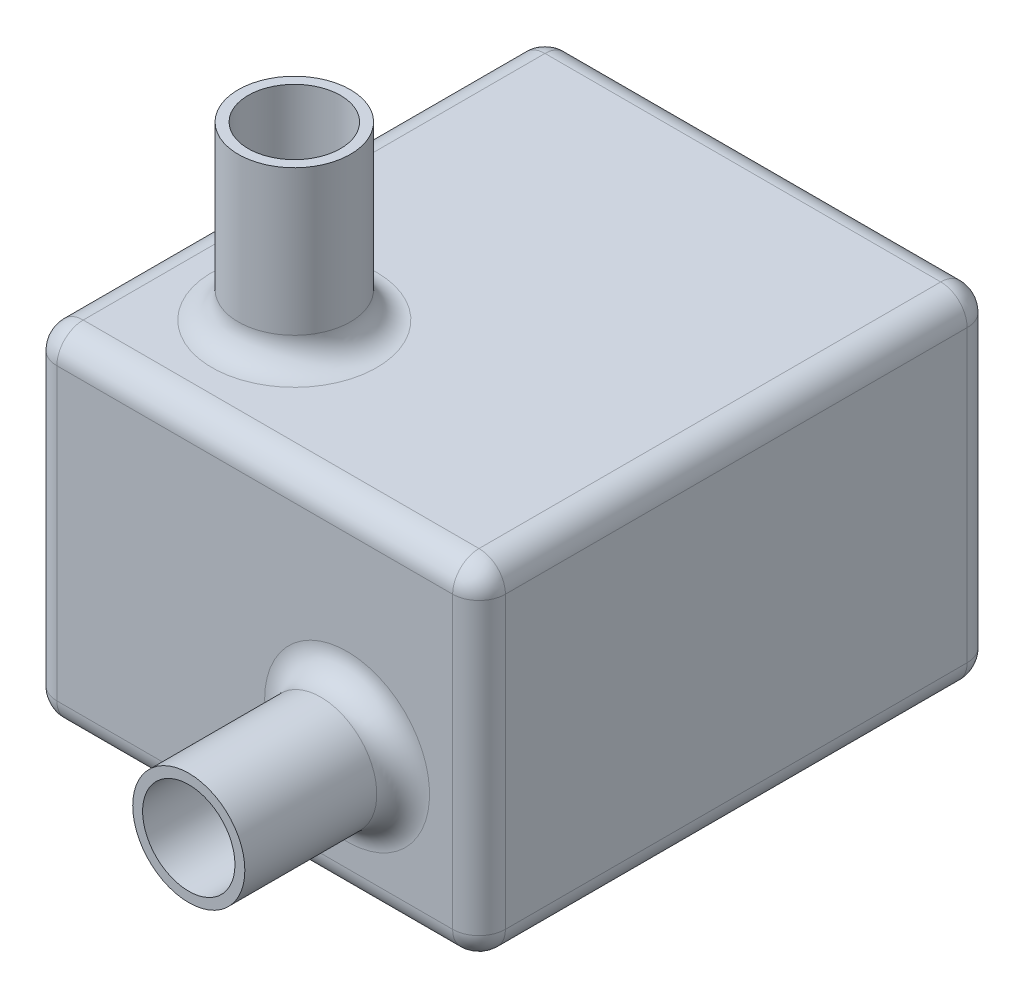
ISO-10303-21;
HEADER;
FILE_DESCRIPTION(('STEP AP214'),'2;1');
FILE_NAME('part.step','',(''),(''),'','','');
FILE_SCHEMA(('AUTOMOTIVE_DESIGN { 1 0 10303 214 1 1 1 1 }'));
ENDSEC;
DATA;
#1=APPLICATION_CONTEXT('core data for automotive mechanical design processes');
#2=APPLICATION_PROTOCOL_DEFINITION('international standard','automotive_design',2000,#1);
#3=PRODUCT_CONTEXT('',#1,'mechanical');
#4=PRODUCT('Part','Part','',(#3));
#5=PRODUCT_RELATED_PRODUCT_CATEGORY('part','',(#4));
#6=PRODUCT_DEFINITION_FORMATION('','',#4);
#7=PRODUCT_DEFINITION_CONTEXT('part definition',#1,'design');
#8=PRODUCT_DEFINITION('design','',#6,#7);
#9=PRODUCT_DEFINITION_SHAPE('','',#8);
#10=(LENGTH_UNIT() NAMED_UNIT(*) SI_UNIT(.MILLI.,.METRE.));
#11=(NAMED_UNIT(*) PLANE_ANGLE_UNIT() SI_UNIT($,.RADIAN.));
#12=(NAMED_UNIT(*) SI_UNIT($,.STERADIAN.) SOLID_ANGLE_UNIT());
#13=UNCERTAINTY_MEASURE_WITH_UNIT(LENGTH_MEASURE(1.E-05),#10,'distance_accuracy_value','');
#14=(GEOMETRIC_REPRESENTATION_CONTEXT(3) GLOBAL_UNCERTAINTY_ASSIGNED_CONTEXT((#13)) GLOBAL_UNIT_ASSIGNED_CONTEXT((#10,
#11,#12)) REPRESENTATION_CONTEXT('',''));
#15=CARTESIAN_POINT('',(0.,0.,0.));
#16=DIRECTION('',(0.,0.,1.));
#17=DIRECTION('',(1.,0.,0.));
#18=AXIS2_PLACEMENT_3D('',#15,#16,#17);
#19=CARTESIAN_POINT('',(17.,26.,19.5));
#20=DIRECTION('',(-1.,0.,0.));
#21=DIRECTION('',(0.,0.,1.));
#22=AXIS2_PLACEMENT_3D('',#19,#20,#21);
#23=PLANE('',#22);
#24=DIRECTION('',(0.,0.,-1.));
#25=VECTOR('',#24,1.);
#26=CARTESIAN_POINT('',(17.,2.,-19.5));
#27=LINE('',#26,#25);
#28=CARTESIAN_POINT('',(17.,2.,17.5));
#29=VERTEX_POINT('',#28);
#30=CARTESIAN_POINT('',(17.,2.,-17.5));
#31=VERTEX_POINT('',#30);
#32=EDGE_CURVE('E202',#29,#31,#27,.T.);
#33=ORIENTED_EDGE('',*,*,#32,.T.);
#34=DIRECTION('',(0.,-1.,0.));
#35=VECTOR('',#34,1.);
#36=CARTESIAN_POINT('',(17.,26.,-17.5));
#37=LINE('',#36,#35);
#38=CARTESIAN_POINT('',(17.,24.,-17.5));
#39=VERTEX_POINT('',#38);
#40=EDGE_CURVE('E205',#31,#39,#37,.F.);
#41=ORIENTED_EDGE('',*,*,#40,.T.);
#42=DIRECTION('',(0.,0.,-1.));
#43=VECTOR('',#42,1.);
#44=CARTESIAN_POINT('',(17.,24.,19.5));
#45=LINE('',#44,#43);
#46=CARTESIAN_POINT('',(17.,24.,17.5));
#47=VERTEX_POINT('',#46);
#48=EDGE_CURVE('E199',#39,#47,#45,.F.);
#49=ORIENTED_EDGE('',*,*,#48,.T.);
#50=DIRECTION('',(0.,-1.,0.));
#51=VECTOR('',#50,1.);
#52=CARTESIAN_POINT('',(17.,26.,17.5));
#53=LINE('',#52,#51);
#54=EDGE_CURVE('E196',#47,#29,#53,.T.);
#55=ORIENTED_EDGE('',*,*,#54,.T.);
#56=EDGE_LOOP('',(#33,#41,#49,#55));
#57=FACE_BOUND('',#56,.T.);
#58=ADVANCED_FACE('F47',(#57),#23,.F.);
#59=CARTESIAN_POINT('',(-17.,26.,-19.5));
#60=DIRECTION('',(0.,0.,1.));
#61=DIRECTION('',(1.,0.,0.));
#62=AXIS2_PLACEMENT_3D('',#59,#60,#61);
#63=PLANE('',#62);
#64=DIRECTION('',(0.,-1.,0.));
#65=VECTOR('',#64,1.);
#66=CARTESIAN_POINT('',(15.,26.,-19.5));
#67=LINE('',#66,#65);
#68=CARTESIAN_POINT('',(15.,24.,-19.5));
#69=VERTEX_POINT('',#68);
#70=CARTESIAN_POINT('',(15.,2.,-19.5));
#71=VERTEX_POINT('',#70);
#72=EDGE_CURVE('E177',#69,#71,#67,.T.);
#73=ORIENTED_EDGE('',*,*,#72,.T.);
#74=DIRECTION('',(-1.,0.,0.));
#75=VECTOR('',#74,1.);
#76=CARTESIAN_POINT('',(-17.,2.,-19.5));
#77=LINE('',#76,#75);
#78=CARTESIAN_POINT('',(-15.,2.,-19.5));
#79=VERTEX_POINT('',#78);
#80=EDGE_CURVE('E145',#71,#79,#77,.T.);
#81=ORIENTED_EDGE('',*,*,#80,.T.);
#82=DIRECTION('',(0.,-1.,0.));
#83=VECTOR('',#82,1.);
#84=CARTESIAN_POINT('',(-15.,26.,-19.5));
#85=LINE('',#84,#83);
#86=CARTESIAN_POINT('',(-15.,24.,-19.5));
#87=VERTEX_POINT('',#86);
#88=EDGE_CURVE('E165',#79,#87,#85,.F.);
#89=ORIENTED_EDGE('',*,*,#88,.T.);
#90=DIRECTION('',(-1.,0.,0.));
#91=VECTOR('',#90,1.);
#92=CARTESIAN_POINT('',(-17.,24.,-19.5));
#93=LINE('',#92,#91);
#94=EDGE_CURVE('E172',#87,#69,#93,.F.);
#95=ORIENTED_EDGE('',*,*,#94,.T.);
#96=EDGE_LOOP('',(#73,#81,#89,#95));
#97=FACE_BOUND('',#96,.T.);
#98=ADVANCED_FACE('F175',(#97),#63,.F.);
#99=CARTESIAN_POINT('',(-17.,26.,19.5));
#100=DIRECTION('',(1.,0.,0.));
#101=DIRECTION('',(0.,0.,-1.));
#102=AXIS2_PLACEMENT_3D('',#99,#100,#101);
#103=PLANE('',#102);
#104=DIRECTION('',(0.,0.,1.));
#105=VECTOR('',#104,1.);
#106=CARTESIAN_POINT('',(-17.,24.,19.5));
#107=LINE('',#106,#105);
#108=CARTESIAN_POINT('',(-17.,24.,17.5));
#109=VERTEX_POINT('',#108);
#110=CARTESIAN_POINT('',(-17.,24.,-17.5));
#111=VERTEX_POINT('',#110);
#112=EDGE_CURVE('E225',#109,#111,#107,.F.);
#113=ORIENTED_EDGE('',*,*,#112,.T.);
#114=DIRECTION('',(0.,-1.,0.));
#115=VECTOR('',#114,1.);
#116=CARTESIAN_POINT('',(-17.,26.,-17.5));
#117=LINE('',#116,#115);
#118=CARTESIAN_POINT('',(-17.,2.,-17.5));
#119=VERTEX_POINT('',#118);
#120=EDGE_CURVE('E231',#111,#119,#117,.T.);
#121=ORIENTED_EDGE('',*,*,#120,.T.);
#122=DIRECTION('',(0.,0.,1.));
#123=VECTOR('',#122,1.);
#124=CARTESIAN_POINT('',(-17.,2.,19.5));
#125=LINE('',#124,#123);
#126=CARTESIAN_POINT('',(-17.,2.,17.5));
#127=VERTEX_POINT('',#126);
#128=EDGE_CURVE('E228',#119,#127,#125,.T.);
#129=ORIENTED_EDGE('',*,*,#128,.T.);
#130=DIRECTION('',(0.,-1.,0.));
#131=VECTOR('',#130,1.);
#132=CARTESIAN_POINT('',(-17.,26.,17.5));
#133=LINE('',#132,#131);
#134=EDGE_CURVE('E222',#127,#109,#133,.F.);
#135=ORIENTED_EDGE('',*,*,#134,.T.);
#136=EDGE_LOOP('',(#113,#121,#129,#135));
#137=FACE_BOUND('',#136,.T.);
#138=ADVANCED_FACE('F352',(#137),#103,.F.);
#139=CARTESIAN_POINT('',(-17.,26.,19.5));
#140=DIRECTION('',(0.,0.,-1.));
#141=DIRECTION('',(-1.,0.,0.));
#142=AXIS2_PLACEMENT_3D('',#139,#140,#141);
#143=PLANE('',#142);
#144=CARTESIAN_POINT('',(7.,10.,19.5));
#145=DIRECTION('',(0.,0.,-1.));
#146=DIRECTION('',(-1.,0.,0.));
#147=AXIS2_PLACEMENT_3D('',#144,#145,#146);
#148=CIRCLE('',#147,6.25);
#149=CARTESIAN_POINT('',(0.750000000000004,10.,19.5));
#150=VERTEX_POINT('',#149);
#151=EDGE_CURVE('E327',#150,#150,#148,.T.);
#152=ORIENTED_EDGE('',*,*,#151,.T.);
#153=EDGE_LOOP('',(#152));
#154=FACE_BOUND('',#153,.T.);
#155=DIRECTION('',(1.,0.,0.));
#156=VECTOR('',#155,1.);
#157=CARTESIAN_POINT('',(-17.,24.,19.5));
#158=LINE('',#157,#156);
#159=CARTESIAN_POINT('',(15.,24.,19.5));
#160=VERTEX_POINT('',#159);
#161=CARTESIAN_POINT('',(-15.,24.,19.5));
#162=VERTEX_POINT('',#161);
#163=EDGE_CURVE('E235',#160,#162,#158,.F.);
#164=ORIENTED_EDGE('',*,*,#163,.T.);
#165=DIRECTION('',(0.,-1.,0.));
#166=VECTOR('',#165,1.);
#167=CARTESIAN_POINT('',(-15.,26.,19.5));
#168=LINE('',#167,#166);
#169=CARTESIAN_POINT('',(-15.,2.,19.5));
#170=VERTEX_POINT('',#169);
#171=EDGE_CURVE('E243',#162,#170,#168,.T.);
#172=ORIENTED_EDGE('',*,*,#171,.T.);
#173=DIRECTION('',(1.,0.,0.));
#174=VECTOR('',#173,1.);
#175=CARTESIAN_POINT('',(17.,2.,19.5));
#176=LINE('',#175,#174);
#177=CARTESIAN_POINT('',(15.,2.,19.5));
#178=VERTEX_POINT('',#177);
#179=EDGE_CURVE('E71',#170,#178,#176,.T.);
#180=ORIENTED_EDGE('',*,*,#179,.T.);
#181=DIRECTION('',(0.,-1.,0.));
#182=VECTOR('',#181,1.);
#183=CARTESIAN_POINT('',(15.,26.,19.5));
#184=LINE('',#183,#182);
#185=EDGE_CURVE('E238',#178,#160,#184,.F.);
#186=ORIENTED_EDGE('',*,*,#185,.T.);
#187=EDGE_LOOP('',(#164,#172,#180,#186));
#188=FACE_BOUND('',#187,.T.);
#189=ADVANCED_FACE('F435',(#154,#188),#143,.F.);
#190=CARTESIAN_POINT('',(0.,26.,0.));
#191=DIRECTION('',(0.,-1.,0.));
#192=DIRECTION('',(0.,0.,-1.));
#193=AXIS2_PLACEMENT_3D('',#190,#191,#192);
#194=PLANE('',#193);
#195=CARTESIAN_POINT('',(-7.,26.,9.49999999999999));
#196=DIRECTION('',(0.,-1.,0.));
#197=DIRECTION('',(0.,0.,-1.));
#198=AXIS2_PLACEMENT_3D('',#195,#196,#197);
#199=CIRCLE('',#198,6.25);
#200=CARTESIAN_POINT('',(-7.,26.,3.24999999999999));
#201=VERTEX_POINT('',#200);
#202=EDGE_CURVE('E11',#201,#201,#199,.T.);
#203=ORIENTED_EDGE('',*,*,#202,.T.);
#204=EDGE_LOOP('',(#203));
#205=FACE_BOUND('',#204,.T.);
#206=DIRECTION('',(0.,0.,-1.));
#207=VECTOR('',#206,1.);
#208=CARTESIAN_POINT('',(15.,26.,0.));
#209=LINE('',#208,#207);
#210=CARTESIAN_POINT('',(15.,26.,17.5));
#211=VERTEX_POINT('',#210);
#212=CARTESIAN_POINT('',(15.,26.,-17.5));
#213=VERTEX_POINT('',#212);
#214=EDGE_CURVE('E212',#211,#213,#209,.T.);
#215=ORIENTED_EDGE('',*,*,#214,.T.);
#216=DIRECTION('',(-1.,0.,0.));
#217=VECTOR('',#216,1.);
#218=CARTESIAN_POINT('',(0.,26.,-17.5));
#219=LINE('',#218,#217);
#220=CARTESIAN_POINT('',(-15.,26.,-17.5));
#221=VERTEX_POINT('',#220);
#222=EDGE_CURVE('E218',#213,#221,#219,.T.);
#223=ORIENTED_EDGE('',*,*,#222,.T.);
#224=DIRECTION('',(0.,0.,1.));
#225=VECTOR('',#224,1.);
#226=CARTESIAN_POINT('',(-15.,26.,0.));
#227=LINE('',#226,#225);
#228=CARTESIAN_POINT('',(-15.,26.,17.5));
#229=VERTEX_POINT('',#228);
#230=EDGE_CURVE('E215',#221,#229,#227,.T.);
#231=ORIENTED_EDGE('',*,*,#230,.T.);
#232=DIRECTION('',(1.,0.,0.));
#233=VECTOR('',#232,1.);
#234=CARTESIAN_POINT('',(0.,26.,17.5));
#235=LINE('',#234,#233);
#236=EDGE_CURVE('E209',#229,#211,#235,.T.);
#237=ORIENTED_EDGE('',*,*,#236,.T.);
#238=EDGE_LOOP('',(#215,#223,#231,#237));
#239=FACE_BOUND('',#238,.T.);
#240=ADVANCED_FACE('F448',(#205,#239),#194,.F.);
#241=CARTESIAN_POINT('',(0.,0.,0.));
#242=DIRECTION('',(0.,-1.,0.));
#243=DIRECTION('',(0.,0.,-1.));
#244=AXIS2_PLACEMENT_3D('',#241,#242,#243);
#245=PLANE('',#244);
#246=DIRECTION('',(0.,0.,1.));
#247=VECTOR('',#246,1.);
#248=CARTESIAN_POINT('',(-15.,0.,-19.5));
#249=LINE('',#248,#247);
#250=CARTESIAN_POINT('',(-15.,0.,17.5));
#251=VERTEX_POINT('',#250);
#252=CARTESIAN_POINT('',(-15.,0.,-17.5));
#253=VERTEX_POINT('',#252);
#254=EDGE_CURVE('E191',#251,#253,#249,.F.);
#255=ORIENTED_EDGE('',*,*,#254,.T.);
#256=DIRECTION('',(-1.,0.,0.));
#257=VECTOR('',#256,1.);
#258=CARTESIAN_POINT('',(17.,0.,-17.5));
#259=LINE('',#258,#257);
#260=CARTESIAN_POINT('',(15.,0.,-17.5));
#261=VERTEX_POINT('',#260);
#262=EDGE_CURVE('E147',#253,#261,#259,.F.);
#263=ORIENTED_EDGE('',*,*,#262,.T.);
#264=DIRECTION('',(0.,0.,-1.));
#265=VECTOR('',#264,1.);
#266=CARTESIAN_POINT('',(15.,0.,19.5));
#267=LINE('',#266,#265);
#268=CARTESIAN_POINT('',(15.,0.,17.5));
#269=VERTEX_POINT('',#268);
#270=EDGE_CURVE('E184',#261,#269,#267,.F.);
#271=ORIENTED_EDGE('',*,*,#270,.T.);
#272=DIRECTION('',(1.,0.,0.));
#273=VECTOR('',#272,1.);
#274=CARTESIAN_POINT('',(-17.,0.,17.5));
#275=LINE('',#274,#273);
#276=EDGE_CURVE('E180',#269,#251,#275,.F.);
#277=ORIENTED_EDGE('',*,*,#276,.T.);
#278=EDGE_LOOP('',(#255,#263,#271,#277));
#279=FACE_BOUND('',#278,.T.);
#280=ADVANCED_FACE('F469',(#279),#245,.T.);
#281=CARTESIAN_POINT('',(-7.,39.,9.49999999999999));
#282=DIRECTION('',(0.,-1.,0.));
#283=DIRECTION('',(0.,0.,-1.));
#284=AXIS2_PLACEMENT_3D('',#281,#282,#283);
#285=CYLINDRICAL_SURFACE('',#284,3.5);
#286=CARTESIAN_POINT('',(-7.,39.,9.49999999999999));
#287=DIRECTION('',(0.,1.,0.));
#288=DIRECTION('',(0.,0.,1.));
#289=AXIS2_PLACEMENT_3D('',#286,#287,#288);
#290=CIRCLE('',#289,3.5);
#291=CARTESIAN_POINT('',(-7.,39.,5.99999999999999));
#292=VERTEX_POINT('',#291);
#293=EDGE_CURVE('E519',#292,#292,#290,.T.);
#294=CARTESIAN_POINT('',(-7.,26.,9.49999999999999));
#295=DIRECTION('',(0.,1.,0.));
#296=DIRECTION('',(0.,0.,1.));
#297=AXIS2_PLACEMENT_3D('',#294,#295,#296);
#298=CIRCLE('',#297,3.5);
#299=CARTESIAN_POINT('',(-7.,26.,5.99999999999999));
#300=VERTEX_POINT('',#299);
#301=EDGE_CURVE('E514',#300,#300,#298,.T.);
#302=CARTESIAN_POINT('',(-7.,39.,5.99999999999999));
#303=CARTESIAN_POINT('',(-7.,38.8645833333333,5.99999999999999));
#304=CARTESIAN_POINT('',(-7.,38.7291666666667,5.99999999999999));
#305=CARTESIAN_POINT('',(-7.,38.4583333333333,5.99999999999999));
#306=CARTESIAN_POINT('',(-7.,38.3229166666667,5.99999999999999));
#307=CARTESIAN_POINT('',(-7.,38.0520833333333,5.99999999999999));
#308=CARTESIAN_POINT('',(-7.,37.9166666666667,5.99999999999999));
#309=CARTESIAN_POINT('',(-7.,37.6458333333333,5.99999999999999));
#310=CARTESIAN_POINT('',(-7.,37.5104166666667,5.99999999999999));
#311=CARTESIAN_POINT('',(-7.,37.2395833333333,5.99999999999999));
#312=CARTESIAN_POINT('',(-7.,37.1041666666667,5.99999999999999));
#313=CARTESIAN_POINT('',(-7.,36.8333333333333,5.99999999999999));
#314=CARTESIAN_POINT('',(-7.,36.6979166666667,5.99999999999999));
#315=CARTESIAN_POINT('',(-7.,36.4270833333333,5.99999999999999));
#316=CARTESIAN_POINT('',(-7.,36.2916666666667,5.99999999999999));
#317=CARTESIAN_POINT('',(-7.,36.0208333333333,5.99999999999999));
#318=CARTESIAN_POINT('',(-7.,35.8854166666667,5.99999999999999));
#319=CARTESIAN_POINT('',(-7.,35.6145833333333,5.99999999999999));
#320=CARTESIAN_POINT('',(-7.,35.4791666666667,5.99999999999999));
#321=CARTESIAN_POINT('',(-7.,35.2083333333333,5.99999999999999));
#322=CARTESIAN_POINT('',(-7.,35.0729166666667,5.99999999999999));
#323=CARTESIAN_POINT('',(-7.,34.8020833333333,5.99999999999999));
#324=CARTESIAN_POINT('',(-7.,34.6666666666667,5.99999999999999));
#325=CARTESIAN_POINT('',(-7.,34.3958333333333,5.99999999999999));
#326=CARTESIAN_POINT('',(-7.,34.2604166666667,5.99999999999999));
#327=CARTESIAN_POINT('',(-7.,33.9895833333333,5.99999999999999));
#328=CARTESIAN_POINT('',(-7.,33.8541666666667,5.99999999999999));
#329=CARTESIAN_POINT('',(-7.,33.5833333333333,5.99999999999999));
#330=CARTESIAN_POINT('',(-7.,33.4479166666667,5.99999999999999));
#331=CARTESIAN_POINT('',(-7.,33.1770833333333,5.99999999999999));
#332=CARTESIAN_POINT('',(-7.,33.0416666666667,5.99999999999999));
#333=CARTESIAN_POINT('',(-7.,32.7708333333333,5.99999999999999));
#334=CARTESIAN_POINT('',(-7.,32.6354166666667,5.99999999999999));
#335=CARTESIAN_POINT('',(-7.,32.3645833333333,5.99999999999999));
#336=CARTESIAN_POINT('',(-7.,32.2291666666667,5.99999999999999));
#337=CARTESIAN_POINT('',(-7.,31.9583333333333,5.99999999999999));
#338=CARTESIAN_POINT('',(-7.,31.8229166666667,5.99999999999999));
#339=CARTESIAN_POINT('',(-7.,31.5520833333333,5.99999999999999));
#340=CARTESIAN_POINT('',(-7.,31.4166666666667,5.99999999999999));
#341=CARTESIAN_POINT('',(-7.,31.1458333333333,5.99999999999999));
#342=CARTESIAN_POINT('',(-7.,31.0104166666667,5.99999999999999));
#343=CARTESIAN_POINT('',(-7.,30.7395833333333,5.99999999999999));
#344=CARTESIAN_POINT('',(-7.,30.6041666666667,5.99999999999999));
#345=CARTESIAN_POINT('',(-7.,30.3333333333333,5.99999999999999));
#346=CARTESIAN_POINT('',(-7.,30.1979166666667,5.99999999999999));
#347=CARTESIAN_POINT('',(-7.,29.9270833333333,5.99999999999999));
#348=CARTESIAN_POINT('',(-7.,29.7916666666667,5.99999999999999));
#349=CARTESIAN_POINT('',(-7.,29.5208333333333,5.99999999999999));
#350=CARTESIAN_POINT('',(-7.,29.3854166666667,5.99999999999999));
#351=CARTESIAN_POINT('',(-7.,29.1145833333333,5.99999999999999));
#352=CARTESIAN_POINT('',(-7.,28.9791666666667,5.99999999999999));
#353=CARTESIAN_POINT('',(-7.,28.7083333333333,5.99999999999999));
#354=CARTESIAN_POINT('',(-7.,28.5729166666667,5.99999999999999));
#355=CARTESIAN_POINT('',(-7.,28.3020833333333,5.99999999999999));
#356=CARTESIAN_POINT('',(-7.,28.1666666666667,5.99999999999999));
#357=CARTESIAN_POINT('',(-7.,27.8958333333333,5.99999999999999));
#358=CARTESIAN_POINT('',(-7.,27.7604166666667,5.99999999999999));
#359=CARTESIAN_POINT('',(-7.,27.4895833333333,5.99999999999999));
#360=CARTESIAN_POINT('',(-7.,27.3541666666667,5.99999999999999));
#361=CARTESIAN_POINT('',(-7.,27.0833333333333,5.99999999999999));
#362=CARTESIAN_POINT('',(-7.,26.9479166666667,5.99999999999999));
#363=CARTESIAN_POINT('',(-7.,26.6770833333333,5.99999999999999));
#364=CARTESIAN_POINT('',(-7.,26.5416666666667,5.99999999999999));
#365=CARTESIAN_POINT('',(-7.,26.2708333333333,5.99999999999999));
#366=CARTESIAN_POINT('',(-7.,26.1354166666667,5.99999999999999));
#367=CARTESIAN_POINT('',(-7.,26.,5.99999999999999));
#368=B_SPLINE_CURVE_WITH_KNOTS('',3,(#302,#303,#304,#305,#306,#307,#308,#309,#310,#311,#312,
#313,#314,#315,#316,#317,#318,#319,#320,#321,#322,#323,#324,#325,#326,#327,#328,#329,#330,#331,
#332,#333,#334,#335,#336,#337,#338,#339,#340,#341,#342,#343,#344,#345,#346,#347,#348,#349,#350,
#351,#352,#353,#354,#355,#356,#357,#358,#359,#360,#361,#362,#363,#364,#365,#366,#367),
.UNSPECIFIED.,.F.,.F.,(4,2,2,2,2,2,2,2,2,2,2,2,2,2,2,2,2,2,2,2,2,2,2,2,2,2,2,2,2,2,2,2,4),(0.,
0.406250000000004,0.812500000000001,1.21875,1.625,2.03125000000001,2.4375,2.84375000000001,3.25,
3.65625000000001,4.0625,4.46875,4.875,5.28125,5.68750000000001,6.09375,6.50000000000001,6.90625,
7.31250000000001,7.71875,8.125,8.53125,8.9375,9.34375000000001,9.75,10.15625,10.5625,10.96875,
11.375,11.78125,12.1875,12.59375,13.),.UNSPECIFIED.);
#369=EDGE_CURVE('BSEAM479',#292,#300,#368,.T.);
#370=ORIENTED_EDGE('',*,*,#293,.T.);
#371=ORIENTED_EDGE('',*,*,#301,.F.);
#372=ORIENTED_EDGE('',*,*,#369,.T.);
#373=ORIENTED_EDGE('',*,*,#369,.F.);
#374=EDGE_LOOP('',(#370,#372,#371,#373));
#375=FACE_BOUND('',#374,.T.);
#376=ADVANCED_FACE('F479',(#375),#285,.F.);
#377=CARTESIAN_POINT('',(-7.,39.,9.49999999999999));
#378=DIRECTION('',(0.,-1.,0.));
#379=DIRECTION('',(0.,0.,-1.));
#380=AXIS2_PLACEMENT_3D('',#377,#378,#379);
#381=CYLINDRICAL_SURFACE('',#380,4.25);
#382=CARTESIAN_POINT('',(-7.,28.,9.49999999999999));
#383=DIRECTION('',(0.,-1.,0.));
#384=DIRECTION('',(0.,0.,-1.));
#385=AXIS2_PLACEMENT_3D('',#382,#383,#384);
#386=CIRCLE('',#385,4.25);
#387=CARTESIAN_POINT('',(-7.,28.,5.24999999999999));
#388=VERTEX_POINT('',#387);
#389=EDGE_CURVE('E56',#388,#388,#386,.F.);
#390=CARTESIAN_POINT('',(-7.,39.,9.49999999999999));
#391=DIRECTION('',(0.,1.,0.));
#392=DIRECTION('',(0.,0.,1.));
#393=AXIS2_PLACEMENT_3D('',#390,#391,#392);
#394=CIRCLE('',#393,4.25);
#395=CARTESIAN_POINT('',(-7.,39.,5.24999999999999));
#396=VERTEX_POINT('',#395);
#397=EDGE_CURVE('E173',#396,#396,#394,.T.);
#398=CARTESIAN_POINT('',(-7.,28.,5.24999999999999));
#399=CARTESIAN_POINT('',(-7.,28.1145833333333,5.24999999999999));
#400=CARTESIAN_POINT('',(-7.,28.2291666666667,5.24999999999999));
#401=CARTESIAN_POINT('',(-7.,28.4583333333333,5.24999999999999));
#402=CARTESIAN_POINT('',(-7.,28.5729166666667,5.24999999999999));
#403=CARTESIAN_POINT('',(-7.,28.8020833333333,5.24999999999999));
#404=CARTESIAN_POINT('',(-7.,28.9166666666667,5.24999999999999));
#405=CARTESIAN_POINT('',(-7.,29.1458333333333,5.24999999999999));
#406=CARTESIAN_POINT('',(-7.,29.2604166666667,5.24999999999999));
#407=CARTESIAN_POINT('',(-7.,29.4895833333333,5.24999999999999));
#408=CARTESIAN_POINT('',(-7.,29.6041666666667,5.24999999999999));
#409=CARTESIAN_POINT('',(-7.,29.8333333333333,5.24999999999999));
#410=CARTESIAN_POINT('',(-7.,29.9479166666667,5.24999999999999));
#411=CARTESIAN_POINT('',(-7.,30.1770833333333,5.24999999999999));
#412=CARTESIAN_POINT('',(-7.,30.2916666666667,5.24999999999999));
#413=CARTESIAN_POINT('',(-7.,30.5208333333333,5.24999999999999));
#414=CARTESIAN_POINT('',(-7.,30.6354166666667,5.24999999999999));
#415=CARTESIAN_POINT('',(-7.,30.8645833333333,5.24999999999999));
#416=CARTESIAN_POINT('',(-7.,30.9791666666667,5.24999999999999));
#417=CARTESIAN_POINT('',(-7.,31.2083333333333,5.24999999999999));
#418=CARTESIAN_POINT('',(-7.,31.3229166666667,5.24999999999999));
#419=CARTESIAN_POINT('',(-7.,31.5520833333333,5.24999999999999));
#420=CARTESIAN_POINT('',(-7.,31.6666666666667,5.24999999999999));
#421=CARTESIAN_POINT('',(-7.,31.8958333333333,5.24999999999999));
#422=CARTESIAN_POINT('',(-7.,32.0104166666667,5.24999999999999));
#423=CARTESIAN_POINT('',(-7.,32.2395833333333,5.24999999999999));
#424=CARTESIAN_POINT('',(-7.,32.3541666666667,5.24999999999999));
#425=CARTESIAN_POINT('',(-7.,32.5833333333333,5.24999999999999));
#426=CARTESIAN_POINT('',(-7.,32.6979166666667,5.24999999999999));
#427=CARTESIAN_POINT('',(-7.,32.9270833333333,5.24999999999999));
#428=CARTESIAN_POINT('',(-7.,33.0416666666667,5.24999999999999));
#429=CARTESIAN_POINT('',(-7.,33.2708333333333,5.24999999999999));
#430=CARTESIAN_POINT('',(-7.,33.3854166666667,5.24999999999999));
#431=CARTESIAN_POINT('',(-7.,33.6145833333333,5.24999999999999));
#432=CARTESIAN_POINT('',(-7.,33.7291666666667,5.24999999999999));
#433=CARTESIAN_POINT('',(-7.,33.9583333333333,5.24999999999999));
#434=CARTESIAN_POINT('',(-7.,34.0729166666667,5.24999999999999));
#435=CARTESIAN_POINT('',(-7.,34.3020833333333,5.24999999999999));
#436=CARTESIAN_POINT('',(-7.,34.4166666666667,5.24999999999999));
#437=CARTESIAN_POINT('',(-7.,34.6458333333333,5.24999999999999));
#438=CARTESIAN_POINT('',(-7.,34.7604166666667,5.24999999999999));
#439=CARTESIAN_POINT('',(-7.,34.9895833333333,5.24999999999999));
#440=CARTESIAN_POINT('',(-7.,35.1041666666667,5.24999999999999));
#441=CARTESIAN_POINT('',(-7.,35.3333333333333,5.24999999999999));
#442=CARTESIAN_POINT('',(-7.,35.4479166666667,5.24999999999999));
#443=CARTESIAN_POINT('',(-7.,35.6770833333333,5.24999999999999));
#444=CARTESIAN_POINT('',(-7.,35.7916666666667,5.24999999999999));
#445=CARTESIAN_POINT('',(-7.,36.0208333333333,5.24999999999999));
#446=CARTESIAN_POINT('',(-7.,36.1354166666667,5.24999999999999));
#447=CARTESIAN_POINT('',(-7.,36.3645833333333,5.24999999999999));
#448=CARTESIAN_POINT('',(-7.,36.4791666666667,5.24999999999999));
#449=CARTESIAN_POINT('',(-7.,36.7083333333333,5.24999999999999));
#450=CARTESIAN_POINT('',(-7.,36.8229166666667,5.24999999999999));
#451=CARTESIAN_POINT('',(-7.,37.0520833333333,5.24999999999999));
#452=CARTESIAN_POINT('',(-7.,37.1666666666667,5.24999999999999));
#453=CARTESIAN_POINT('',(-7.,37.3958333333333,5.24999999999999));
#454=CARTESIAN_POINT('',(-7.,37.5104166666667,5.24999999999999));
#455=CARTESIAN_POINT('',(-7.,37.7395833333333,5.24999999999999));
#456=CARTESIAN_POINT('',(-7.,37.8541666666667,5.24999999999999));
#457=CARTESIAN_POINT('',(-7.,38.0833333333333,5.24999999999999));
#458=CARTESIAN_POINT('',(-7.,38.1979166666667,5.24999999999999));
#459=CARTESIAN_POINT('',(-7.,38.4270833333333,5.24999999999999));
#460=CARTESIAN_POINT('',(-7.,38.5416666666667,5.24999999999999));
#461=CARTESIAN_POINT('',(-7.,38.7708333333333,5.24999999999999));
#462=CARTESIAN_POINT('',(-7.,38.8854166666667,5.24999999999999));
#463=CARTESIAN_POINT('',(-7.,39.,5.24999999999999));
#464=B_SPLINE_CURVE_WITH_KNOTS('',3,(#398,#399,#400,#401,#402,#403,#404,#405,#406,#407,#408,
#409,#410,#411,#412,#413,#414,#415,#416,#417,#418,#419,#420,#421,#422,#423,#424,#425,#426,#427,
#428,#429,#430,#431,#432,#433,#434,#435,#436,#437,#438,#439,#440,#441,#442,#443,#444,#445,#446,
#447,#448,#449,#450,#451,#452,#453,#454,#455,#456,#457,#458,#459,#460,#461,#462,#463),
.UNSPECIFIED.,.F.,.F.,(4,2,2,2,2,2,2,2,2,2,2,2,2,2,2,2,2,2,2,2,2,2,2,2,2,2,2,2,2,2,2,2,4),(0.,
0.343750000000004,0.687500000000001,1.03125,1.375,1.71875,2.0625,2.40625,2.75,3.09375,3.4375,
3.78125,4.125,4.46875,4.8125,5.15625,5.5,5.84375,6.1875,6.53125,6.875,7.21875,7.5625,7.90625,
8.25,8.59375,8.9375,9.28125,9.625,9.96875,10.3125,10.65625,11.),.UNSPECIFIED.);
#465=EDGE_CURVE('BSEAM334',#388,#396,#464,.T.);
#466=ORIENTED_EDGE('',*,*,#389,.T.);
#467=ORIENTED_EDGE('',*,*,#397,.F.);
#468=ORIENTED_EDGE('',*,*,#465,.T.);
#469=ORIENTED_EDGE('',*,*,#465,.F.);
#470=EDGE_LOOP('',(#466,#468,#467,#469));
#471=FACE_BOUND('',#470,.T.);
#472=ADVANCED_FACE('F334',(#471),#381,.T.);
#473=CARTESIAN_POINT('',(0.,39.,0.));
#474=DIRECTION('',(0.,1.,0.));
#475=DIRECTION('',(0.,0.,1.));
#476=AXIS2_PLACEMENT_3D('',#473,#474,#475);
#477=PLANE('',#476);
#478=ORIENTED_EDGE('',*,*,#293,.F.);
#479=EDGE_LOOP('',(#478));
#480=FACE_BOUND('',#479,.T.);
#481=ORIENTED_EDGE('',*,*,#397,.T.);
#482=EDGE_LOOP('',(#481));
#483=FACE_BOUND('',#482,.T.);
#484=ADVANCED_FACE('F489',(#480,#483),#477,.T.);
#485=ORIENTED_EDGE('',*,*,#301,.T.);
#486=EDGE_LOOP('',(#485));
#487=FACE_BOUND('',#486,.T.);
#488=ADVANCED_FACE('F483',(#487),#194,.F.);
#489=CARTESIAN_POINT('',(7.,10.,31.5));
#490=DIRECTION('',(0.,0.,-1.));
#491=DIRECTION('',(-1.,0.,0.));
#492=AXIS2_PLACEMENT_3D('',#489,#490,#491);
#493=CYLINDRICAL_SURFACE('',#492,3.5);
#494=CARTESIAN_POINT('',(7.,10.,31.5));
#495=DIRECTION('',(0.,0.,1.));
#496=DIRECTION('',(1.,0.,0.));
#497=AXIS2_PLACEMENT_3D('',#494,#495,#496);
#498=CIRCLE('',#497,3.5);
#499=CARTESIAN_POINT('',(10.5,10.,31.5));
#500=VERTEX_POINT('',#499);
#501=EDGE_CURVE('E508',#500,#500,#498,.T.);
#502=ORIENTED_EDGE('',*,*,#501,.T.);
#503=EDGE_LOOP('',(#502));
#504=FACE_BOUND('',#503,.T.);
#505=CARTESIAN_POINT('',(7.,10.,19.5));
#506=DIRECTION('',(0.,0.,1.));
#507=DIRECTION('',(1.,0.,0.));
#508=AXIS2_PLACEMENT_3D('',#505,#506,#507);
#509=CIRCLE('',#508,3.5);
#510=CARTESIAN_POINT('',(10.5,10.,19.5));
#511=VERTEX_POINT('',#510);
#512=EDGE_CURVE('E323',#511,#511,#509,.T.);
#513=ORIENTED_EDGE('',*,*,#512,.F.);
#514=EDGE_LOOP('',(#513));
#515=FACE_BOUND('',#514,.T.);
#516=ADVANCED_FACE('F493',(#504,#515),#493,.F.);
#517=CARTESIAN_POINT('',(7.,10.,31.5));
#518=DIRECTION('',(0.,0.,-1.));
#519=DIRECTION('',(-1.,0.,0.));
#520=AXIS2_PLACEMENT_3D('',#517,#518,#519);
#521=CYLINDRICAL_SURFACE('',#520,4.25);
#522=CARTESIAN_POINT('',(7.,10.,21.5));
#523=DIRECTION('',(0.,0.,-1.));
#524=DIRECTION('',(-1.,0.,0.));
#525=AXIS2_PLACEMENT_3D('',#522,#523,#524);
#526=CIRCLE('',#525,4.25);
#527=CARTESIAN_POINT('',(2.75,10.,21.5));
#528=VERTEX_POINT('',#527);
#529=EDGE_CURVE('E245',#528,#528,#526,.F.);
#530=ORIENTED_EDGE('',*,*,#529,.T.);
#531=EDGE_LOOP('',(#530));
#532=FACE_BOUND('',#531,.T.);
#533=CARTESIAN_POINT('',(7.,10.,31.5));
#534=DIRECTION('',(0.,0.,1.));
#535=DIRECTION('',(1.,0.,0.));
#536=AXIS2_PLACEMENT_3D('',#533,#534,#535);
#537=CIRCLE('',#536,4.25);
#538=CARTESIAN_POINT('',(11.25,10.,31.5));
#539=VERTEX_POINT('',#538);
#540=EDGE_CURVE('E511',#539,#539,#537,.T.);
#541=ORIENTED_EDGE('',*,*,#540,.F.);
#542=EDGE_LOOP('',(#541));
#543=FACE_BOUND('',#542,.T.);
#544=ADVANCED_FACE('F496',(#532,#543),#521,.T.);
#545=CARTESIAN_POINT('',(0.,0.,31.5));
#546=DIRECTION('',(0.,0.,1.));
#547=DIRECTION('',(1.,0.,0.));
#548=AXIS2_PLACEMENT_3D('',#545,#546,#547);
#549=PLANE('',#548);
#550=ORIENTED_EDGE('',*,*,#501,.F.);
#551=EDGE_LOOP('',(#550));
#552=FACE_BOUND('',#551,.T.);
#553=ORIENTED_EDGE('',*,*,#540,.T.);
#554=EDGE_LOOP('',(#553));
#555=FACE_BOUND('',#554,.T.);
#556=ADVANCED_FACE('F432',(#552,#555),#549,.T.);
#557=ORIENTED_EDGE('',*,*,#512,.T.);
#558=EDGE_LOOP('',(#557));
#559=FACE_BOUND('',#558,.T.);
#560=ADVANCED_FACE('F427',(#559),#143,.F.);
#561=CARTESIAN_POINT('',(0.,24.,17.5));
#562=DIRECTION('',(1.,0.,0.));
#563=DIRECTION('',(0.,0.,-1.));
#564=AXIS2_PLACEMENT_3D('',#561,#562,#563);
#565=CYLINDRICAL_SURFACE('',#564,2.);
#566=CARTESIAN_POINT('',(15.,24.,17.5));
#567=DIRECTION('',(1.,0.,0.));
#568=DIRECTION('',(0.,0.,-1.));
#569=AXIS2_PLACEMENT_3D('',#566,#567,#568);
#570=CIRCLE('',#569,2.);
#571=EDGE_CURVE('E319',#211,#160,#570,.T.);
#572=ORIENTED_EDGE('',*,*,#571,.F.);
#573=ORIENTED_EDGE('',*,*,#236,.F.);
#574=CARTESIAN_POINT('',(-15.,24.,17.5));
#575=DIRECTION('',(-1.,0.,0.));
#576=DIRECTION('',(0.,0.,1.));
#577=AXIS2_PLACEMENT_3D('',#574,#575,#576);
#578=CIRCLE('',#577,2.);
#579=EDGE_CURVE('E315',#162,#229,#578,.T.);
#580=ORIENTED_EDGE('',*,*,#579,.F.);
#581=ORIENTED_EDGE('',*,*,#163,.F.);
#582=EDGE_LOOP('',(#572,#573,#580,#581));
#583=FACE_BOUND('',#582,.T.);
#584=ADVANCED_FACE('F424',(#583),#565,.T.);
#585=CARTESIAN_POINT('',(15.,24.,17.5));
#586=DIRECTION('',(0.,0.,1.));
#587=DIRECTION('',(1.,0.,0.));
#588=AXIS2_PLACEMENT_3D('',#585,#586,#587);
#589=SPHERICAL_SURFACE('',#588,2.);
#590=CARTESIAN_POINT('',(15.,24.,17.5));
#591=DIRECTION('',(0.,0.,1.));
#592=DIRECTION('',(1.,0.,0.));
#593=AXIS2_PLACEMENT_3D('',#590,#591,#592);
#594=CIRCLE('',#593,2.);
#595=EDGE_CURVE('E307',#211,#47,#594,.F.);
#596=ORIENTED_EDGE('',*,*,#595,.F.);
#597=ORIENTED_EDGE('',*,*,#571,.T.);
#598=CARTESIAN_POINT('',(15.,24.,17.5));
#599=DIRECTION('',(0.,1.,0.));
#600=DIRECTION('',(0.,0.,1.));
#601=AXIS2_PLACEMENT_3D('',#598,#599,#600);
#602=CIRCLE('',#601,2.);
#603=EDGE_CURVE('E311',#47,#160,#602,.F.);
#604=ORIENTED_EDGE('',*,*,#603,.F.);
#605=EDGE_LOOP('',(#596,#597,#604));
#606=FACE_BOUND('',#605,.T.);
#607=ADVANCED_FACE('F420',(#606),#589,.T.);
#608=CARTESIAN_POINT('',(-15.,24.,17.5));
#609=DIRECTION('',(0.,1.,0.));
#610=DIRECTION('',(0.,0.,1.));
#611=AXIS2_PLACEMENT_3D('',#608,#609,#610);
#612=SPHERICAL_SURFACE('',#611,2.);
#613=CARTESIAN_POINT('',(-15.,24.,17.5));
#614=DIRECTION('',(0.,1.,0.));
#615=DIRECTION('',(0.,0.,1.));
#616=AXIS2_PLACEMENT_3D('',#613,#614,#615);
#617=CIRCLE('',#616,2.);
#618=EDGE_CURVE('E299',#162,#109,#617,.F.);
#619=ORIENTED_EDGE('',*,*,#618,.F.);
#620=ORIENTED_EDGE('',*,*,#579,.T.);
#621=CARTESIAN_POINT('',(-15.,24.,17.5));
#622=DIRECTION('',(0.,0.,1.));
#623=DIRECTION('',(1.,0.,0.));
#624=AXIS2_PLACEMENT_3D('',#621,#622,#623);
#625=CIRCLE('',#624,2.);
#626=EDGE_CURVE('E303',#109,#229,#625,.F.);
#627=ORIENTED_EDGE('',*,*,#626,.F.);
#628=EDGE_LOOP('',(#619,#620,#627));
#629=FACE_BOUND('',#628,.T.);
#630=ADVANCED_FACE('F416',(#629),#612,.T.);
#631=CARTESIAN_POINT('',(15.,26.,17.5));
#632=DIRECTION('',(0.,-1.,0.));
#633=DIRECTION('',(0.,0.,-1.));
#634=AXIS2_PLACEMENT_3D('',#631,#632,#633);
#635=CYLINDRICAL_SURFACE('',#634,2.);
#636=ORIENTED_EDGE('',*,*,#603,.T.);
#637=ORIENTED_EDGE('',*,*,#185,.F.);
#638=CARTESIAN_POINT('',(15.,2.,17.5));
#639=DIRECTION('',(0.,-1.,0.));
#640=DIRECTION('',(0.,0.,-1.));
#641=AXIS2_PLACEMENT_3D('',#638,#639,#640);
#642=CIRCLE('',#641,2.);
#643=EDGE_CURVE('E291',#29,#178,#642,.T.);
#644=ORIENTED_EDGE('',*,*,#643,.F.);
#645=ORIENTED_EDGE('',*,*,#54,.F.);
#646=EDGE_LOOP('',(#636,#637,#644,#645));
#647=FACE_BOUND('',#646,.T.);
#648=ADVANCED_FACE('F412',(#647),#635,.T.);
#649=CARTESIAN_POINT('',(15.,24.,0.));
#650=DIRECTION('',(0.,0.,-1.));
#651=DIRECTION('',(-1.,0.,0.));
#652=AXIS2_PLACEMENT_3D('',#649,#650,#651);
#653=CYLINDRICAL_SURFACE('',#652,2.);
#654=ORIENTED_EDGE('',*,*,#595,.T.);
#655=ORIENTED_EDGE('',*,*,#48,.F.);
#656=CARTESIAN_POINT('',(15.,24.,-17.5));
#657=DIRECTION('',(0.,0.,-1.));
#658=DIRECTION('',(-1.,0.,0.));
#659=AXIS2_PLACEMENT_3D('',#656,#657,#658);
#660=CIRCLE('',#659,2.);
#661=EDGE_CURVE('E287',#213,#39,#660,.T.);
#662=ORIENTED_EDGE('',*,*,#661,.F.);
#663=ORIENTED_EDGE('',*,*,#214,.F.);
#664=EDGE_LOOP('',(#654,#655,#662,#663));
#665=FACE_BOUND('',#664,.T.);
#666=ADVANCED_FACE('F408',(#665),#653,.T.);
#667=CARTESIAN_POINT('',(0.,24.,-17.5));
#668=DIRECTION('',(-1.,0.,0.));
#669=DIRECTION('',(0.,0.,1.));
#670=AXIS2_PLACEMENT_3D('',#667,#668,#669);
#671=CYLINDRICAL_SURFACE('',#670,2.);
#672=CARTESIAN_POINT('',(-15.,24.,-17.5));
#673=DIRECTION('',(-1.,0.,0.));
#674=DIRECTION('',(0.,0.,1.));
#675=AXIS2_PLACEMENT_3D('',#672,#673,#674);
#676=CIRCLE('',#675,2.);
#677=EDGE_CURVE('E279',#221,#87,#676,.T.);
#678=ORIENTED_EDGE('',*,*,#677,.F.);
#679=ORIENTED_EDGE('',*,*,#222,.F.);
#680=CARTESIAN_POINT('',(15.,24.,-17.5));
#681=DIRECTION('',(1.,0.,0.));
#682=DIRECTION('',(0.,1.,0.));
#683=AXIS2_PLACEMENT_3D('',#680,#681,#682);
#684=CIRCLE('',#683,2.);
#685=EDGE_CURVE('E283',#69,#213,#684,.T.);
#686=ORIENTED_EDGE('',*,*,#685,.F.);
#687=ORIENTED_EDGE('',*,*,#94,.F.);
#688=EDGE_LOOP('',(#678,#679,#686,#687));
#689=FACE_BOUND('',#688,.T.);
#690=ADVANCED_FACE('F404',(#689),#671,.T.);
#691=CARTESIAN_POINT('',(-15.,24.,0.));
#692=DIRECTION('',(0.,0.,1.));
#693=DIRECTION('',(1.,0.,0.));
#694=AXIS2_PLACEMENT_3D('',#691,#692,#693);
#695=CYLINDRICAL_SURFACE('',#694,2.);
#696=ORIENTED_EDGE('',*,*,#626,.T.);
#697=ORIENTED_EDGE('',*,*,#230,.F.);
#698=CARTESIAN_POINT('',(-15.,24.,-17.5));
#699=DIRECTION('',(0.,0.,-1.));
#700=DIRECTION('',(0.,1.,0.));
#701=AXIS2_PLACEMENT_3D('',#698,#699,#700);
#702=CIRCLE('',#701,2.);
#703=EDGE_CURVE('E276',#111,#221,#702,.T.);
#704=ORIENTED_EDGE('',*,*,#703,.F.);
#705=ORIENTED_EDGE('',*,*,#112,.F.);
#706=EDGE_LOOP('',(#696,#697,#704,#705));
#707=FACE_BOUND('',#706,.T.);
#708=ADVANCED_FACE('F400',(#707),#695,.T.);
#709=CARTESIAN_POINT('',(-15.,26.,17.5));
#710=DIRECTION('',(0.,-1.,0.));
#711=DIRECTION('',(0.,0.,-1.));
#712=AXIS2_PLACEMENT_3D('',#709,#710,#711);
#713=CYLINDRICAL_SURFACE('',#712,2.);
#714=ORIENTED_EDGE('',*,*,#618,.T.);
#715=ORIENTED_EDGE('',*,*,#134,.F.);
#716=CARTESIAN_POINT('',(-15.,2.,17.5));
#717=DIRECTION('',(0.,-1.,0.));
#718=DIRECTION('',(0.,0.,-1.));
#719=AXIS2_PLACEMENT_3D('',#716,#717,#718);
#720=CIRCLE('',#719,2.);
#721=EDGE_CURVE('E273',#170,#127,#720,.T.);
#722=ORIENTED_EDGE('',*,*,#721,.F.);
#723=ORIENTED_EDGE('',*,*,#171,.F.);
#724=EDGE_LOOP('',(#714,#715,#722,#723));
#725=FACE_BOUND('',#724,.T.);
#726=ADVANCED_FACE('F396',(#725),#713,.T.);
#727=CARTESIAN_POINT('',(-17.,2.,17.5));
#728=DIRECTION('',(-1.,0.,0.));
#729=DIRECTION('',(0.,0.,1.));
#730=AXIS2_PLACEMENT_3D('',#727,#728,#729);
#731=CYLINDRICAL_SURFACE('',#730,2.);
#732=CARTESIAN_POINT('',(15.,2.,17.5));
#733=DIRECTION('',(1.,0.,0.));
#734=DIRECTION('',(0.,0.,-1.));
#735=AXIS2_PLACEMENT_3D('',#732,#733,#734);
#736=CIRCLE('',#735,2.);
#737=EDGE_CURVE('E295',#178,#269,#736,.T.);
#738=ORIENTED_EDGE('',*,*,#737,.F.);
#739=ORIENTED_EDGE('',*,*,#179,.F.);
#740=CARTESIAN_POINT('',(-15.,2.,17.5));
#741=DIRECTION('',(-1.,0.,0.));
#742=DIRECTION('',(0.,0.,1.));
#743=AXIS2_PLACEMENT_3D('',#740,#741,#742);
#744=CIRCLE('',#743,2.);
#745=EDGE_CURVE('E63',#251,#170,#744,.T.);
#746=ORIENTED_EDGE('',*,*,#745,.F.);
#747=ORIENTED_EDGE('',*,*,#276,.F.);
#748=EDGE_LOOP('',(#738,#739,#746,#747));
#749=FACE_BOUND('',#748,.T.);
#750=ADVANCED_FACE('F392',(#749),#731,.T.);
#751=CARTESIAN_POINT('',(15.,2.,17.5));
#752=DIRECTION('',(0.,0.,1.));
#753=DIRECTION('',(0.,-1.,0.));
#754=AXIS2_PLACEMENT_3D('',#751,#752,#753);
#755=SPHERICAL_SURFACE('',#754,2.);
#756=ORIENTED_EDGE('',*,*,#643,.T.);
#757=ORIENTED_EDGE('',*,*,#737,.T.);
#758=CARTESIAN_POINT('',(15.,2.,17.5));
#759=DIRECTION('',(0.,0.,1.));
#760=DIRECTION('',(1.,0.,0.));
#761=AXIS2_PLACEMENT_3D('',#758,#759,#760);
#762=CIRCLE('',#761,2.);
#763=EDGE_CURVE('E267',#29,#269,#762,.F.);
#764=ORIENTED_EDGE('',*,*,#763,.F.);
#765=EDGE_LOOP('',(#756,#757,#764));
#766=FACE_BOUND('',#765,.T.);
#767=ADVANCED_FACE('F388',(#766),#755,.T.);
#768=CARTESIAN_POINT('',(15.,24.,-17.5));
#769=DIRECTION('',(0.,1.,0.));
#770=DIRECTION('',(0.,0.,1.));
#771=AXIS2_PLACEMENT_3D('',#768,#769,#770);
#772=SPHERICAL_SURFACE('',#771,2.);
#773=ORIENTED_EDGE('',*,*,#685,.T.);
#774=ORIENTED_EDGE('',*,*,#661,.T.);
#775=CARTESIAN_POINT('',(15.,24.,-17.5));
#776=DIRECTION('',(0.,1.,0.));
#777=DIRECTION('',(0.,0.,1.));
#778=AXIS2_PLACEMENT_3D('',#775,#776,#777);
#779=CIRCLE('',#778,2.);
#780=EDGE_CURVE('E264',#69,#39,#779,.F.);
#781=ORIENTED_EDGE('',*,*,#780,.F.);
#782=EDGE_LOOP('',(#773,#774,#781));
#783=FACE_BOUND('',#782,.T.);
#784=ADVANCED_FACE('F384',(#783),#772,.T.);
#785=CARTESIAN_POINT('',(-15.,24.,-17.5));
#786=DIRECTION('',(0.,1.,0.));
#787=DIRECTION('',(0.,0.,1.));
#788=AXIS2_PLACEMENT_3D('',#785,#786,#787);
#789=SPHERICAL_SURFACE('',#788,2.);
#790=ORIENTED_EDGE('',*,*,#703,.T.);
#791=ORIENTED_EDGE('',*,*,#677,.T.);
#792=CARTESIAN_POINT('',(-15.,24.,-17.5));
#793=DIRECTION('',(0.,1.,0.));
#794=DIRECTION('',(0.,0.,1.));
#795=AXIS2_PLACEMENT_3D('',#792,#793,#794);
#796=CIRCLE('',#795,2.);
#797=EDGE_CURVE('E168',#111,#87,#796,.F.);
#798=ORIENTED_EDGE('',*,*,#797,.F.);
#799=EDGE_LOOP('',(#790,#791,#798));
#800=FACE_BOUND('',#799,.T.);
#801=ADVANCED_FACE('F381',(#800),#789,.T.);
#802=CARTESIAN_POINT('',(-15.,2.,17.5));
#803=DIRECTION('',(0.,0.,1.));
#804=DIRECTION('',(0.,-1.,0.));
#805=AXIS2_PLACEMENT_3D('',#802,#803,#804);
#806=SPHERICAL_SURFACE('',#805,2.);
#807=ORIENTED_EDGE('',*,*,#745,.T.);
#808=ORIENTED_EDGE('',*,*,#721,.T.);
#809=CARTESIAN_POINT('',(-15.,2.,17.5));
#810=DIRECTION('',(0.,0.,1.));
#811=DIRECTION('',(1.,0.,0.));
#812=AXIS2_PLACEMENT_3D('',#809,#810,#811);
#813=CIRCLE('',#812,2.);
#814=EDGE_CURVE('E258',#251,#127,#813,.F.);
#815=ORIENTED_EDGE('',*,*,#814,.F.);
#816=EDGE_LOOP('',(#807,#808,#815));
#817=FACE_BOUND('',#816,.T.);
#818=ADVANCED_FACE('F377',(#817),#806,.T.);
#819=CARTESIAN_POINT('',(15.,2.,19.5));
#820=DIRECTION('',(0.,0.,1.));
#821=DIRECTION('',(1.,0.,0.));
#822=AXIS2_PLACEMENT_3D('',#819,#820,#821);
#823=CYLINDRICAL_SURFACE('',#822,2.);
#824=ORIENTED_EDGE('',*,*,#763,.T.);
#825=ORIENTED_EDGE('',*,*,#270,.F.);
#826=CARTESIAN_POINT('',(15.,2.,-17.5));
#827=DIRECTION('',(0.,0.,-1.));
#828=DIRECTION('',(-1.,0.,0.));
#829=AXIS2_PLACEMENT_3D('',#826,#827,#828);
#830=CIRCLE('',#829,2.);
#831=EDGE_CURVE('E254',#31,#261,#830,.T.);
#832=ORIENTED_EDGE('',*,*,#831,.F.);
#833=ORIENTED_EDGE('',*,*,#32,.F.);
#834=EDGE_LOOP('',(#824,#825,#832,#833));
#835=FACE_BOUND('',#834,.T.);
#836=ADVANCED_FACE('F373',(#835),#823,.T.);
#837=CARTESIAN_POINT('',(15.,26.,-17.5));
#838=DIRECTION('',(0.,-1.,0.));
#839=DIRECTION('',(0.,0.,-1.));
#840=AXIS2_PLACEMENT_3D('',#837,#838,#839);
#841=CYLINDRICAL_SURFACE('',#840,2.);
#842=ORIENTED_EDGE('',*,*,#780,.T.);
#843=ORIENTED_EDGE('',*,*,#40,.F.);
#844=CARTESIAN_POINT('',(15.,2.,-17.5));
#845=DIRECTION('',(0.,-1.,0.));
#846=DIRECTION('',(0.,0.,-1.));
#847=AXIS2_PLACEMENT_3D('',#844,#845,#846);
#848=CIRCLE('',#847,2.);
#849=EDGE_CURVE('E162',#71,#31,#848,.T.);
#850=ORIENTED_EDGE('',*,*,#849,.F.);
#851=ORIENTED_EDGE('',*,*,#72,.F.);
#852=EDGE_LOOP('',(#842,#843,#850,#851));
#853=FACE_BOUND('',#852,.T.);
#854=ADVANCED_FACE('F370',(#853),#841,.T.);
#855=CARTESIAN_POINT('',(-15.,26.,-17.5));
#856=DIRECTION('',(0.,-1.,0.));
#857=DIRECTION('',(0.,0.,-1.));
#858=AXIS2_PLACEMENT_3D('',#855,#856,#857);
#859=CYLINDRICAL_SURFACE('',#858,2.);
#860=ORIENTED_EDGE('',*,*,#797,.T.);
#861=ORIENTED_EDGE('',*,*,#88,.F.);
#862=CARTESIAN_POINT('',(-15.,2.,-17.5));
#863=DIRECTION('',(0.,-1.,0.));
#864=DIRECTION('',(0.,0.,-1.));
#865=AXIS2_PLACEMENT_3D('',#862,#863,#864);
#866=CIRCLE('',#865,2.);
#867=EDGE_CURVE('E153',#119,#79,#866,.T.);
#868=ORIENTED_EDGE('',*,*,#867,.F.);
#869=ORIENTED_EDGE('',*,*,#120,.F.);
#870=EDGE_LOOP('',(#860,#861,#868,#869));
#871=FACE_BOUND('',#870,.T.);
#872=ADVANCED_FACE('F166',(#871),#859,.T.);
#873=CARTESIAN_POINT('',(-15.,2.,19.5));
#874=DIRECTION('',(0.,0.,-1.));
#875=DIRECTION('',(-1.,0.,0.));
#876=AXIS2_PLACEMENT_3D('',#873,#874,#875);
#877=CYLINDRICAL_SURFACE('',#876,2.);
#878=ORIENTED_EDGE('',*,*,#814,.T.);
#879=ORIENTED_EDGE('',*,*,#128,.F.);
#880=CARTESIAN_POINT('',(-15.,2.,-17.5));
#881=DIRECTION('',(0.,0.,-1.));
#882=DIRECTION('',(-1.,0.,0.));
#883=AXIS2_PLACEMENT_3D('',#880,#881,#882);
#884=CIRCLE('',#883,2.);
#885=EDGE_CURVE('E157',#253,#119,#884,.T.);
#886=ORIENTED_EDGE('',*,*,#885,.F.);
#887=ORIENTED_EDGE('',*,*,#254,.F.);
#888=EDGE_LOOP('',(#878,#879,#886,#887));
#889=FACE_BOUND('',#888,.T.);
#890=ADVANCED_FACE('F363',(#889),#877,.T.);
#891=CARTESIAN_POINT('',(15.,2.,-17.5));
#892=DIRECTION('',(1.,0.,0.));
#893=DIRECTION('',(0.,1.,0.));
#894=AXIS2_PLACEMENT_3D('',#891,#892,#893);
#895=SPHERICAL_SURFACE('',#894,2.);
#896=ORIENTED_EDGE('',*,*,#849,.T.);
#897=ORIENTED_EDGE('',*,*,#831,.T.);
#898=CARTESIAN_POINT('',(15.,2.,-17.5));
#899=DIRECTION('',(1.,0.,0.));
#900=DIRECTION('',(0.,0.,-1.));
#901=AXIS2_PLACEMENT_3D('',#898,#899,#900);
#902=CIRCLE('',#901,2.);
#903=EDGE_CURVE('E150',#71,#261,#902,.F.);
#904=ORIENTED_EDGE('',*,*,#903,.F.);
#905=EDGE_LOOP('',(#896,#897,#904));
#906=FACE_BOUND('',#905,.T.);
#907=ADVANCED_FACE('F360',(#906),#895,.T.);
#908=CARTESIAN_POINT('',(-15.,2.,-17.5));
#909=DIRECTION('',(-1.,0.,0.));
#910=DIRECTION('',(0.,0.,1.));
#911=AXIS2_PLACEMENT_3D('',#908,#909,#910);
#912=SPHERICAL_SURFACE('',#911,2.);
#913=ORIENTED_EDGE('',*,*,#885,.T.);
#914=ORIENTED_EDGE('',*,*,#867,.T.);
#915=CARTESIAN_POINT('',(-15.,2.,-17.5));
#916=DIRECTION('',(-1.,0.,0.));
#917=DIRECTION('',(0.,0.,1.));
#918=AXIS2_PLACEMENT_3D('',#915,#916,#917);
#919=CIRCLE('',#918,2.);
#920=EDGE_CURVE('E141',#253,#79,#919,.F.);
#921=ORIENTED_EDGE('',*,*,#920,.F.);
#922=EDGE_LOOP('',(#913,#914,#921));
#923=FACE_BOUND('',#922,.T.);
#924=ADVANCED_FACE('F155',(#923),#912,.T.);
#925=CARTESIAN_POINT('',(-17.,2.,-17.5));
#926=DIRECTION('',(1.,0.,0.));
#927=DIRECTION('',(0.,0.,-1.));
#928=AXIS2_PLACEMENT_3D('',#925,#926,#927);
#929=CYLINDRICAL_SURFACE('',#928,2.);
#930=ORIENTED_EDGE('',*,*,#903,.T.);
#931=ORIENTED_EDGE('',*,*,#262,.F.);
#932=ORIENTED_EDGE('',*,*,#920,.T.);
#933=ORIENTED_EDGE('',*,*,#80,.F.);
#934=EDGE_LOOP('',(#930,#931,#932,#933));
#935=FACE_BOUND('',#934,.T.);
#936=ADVANCED_FACE('F143',(#935),#929,.T.);
#937=CARTESIAN_POINT('',(7.,10.,21.5));
#938=DIRECTION('',(0.,0.,-1.));
#939=DIRECTION('',(-1.,0.,0.));
#940=AXIS2_PLACEMENT_3D('',#937,#938,#939);
#941=TOROIDAL_SURFACE('',#940,6.25,2.);
#942=ORIENTED_EDGE('',*,*,#151,.F.);
#943=EDGE_LOOP('',(#942));
#944=FACE_BOUND('',#943,.T.);
#945=ORIENTED_EDGE('',*,*,#529,.F.);
#946=EDGE_LOOP('',(#945));
#947=FACE_BOUND('',#946,.T.);
#948=ADVANCED_FACE('F338',(#944,#947),#941,.F.);
#949=CARTESIAN_POINT('',(-7.,28.,9.49999999999999));
#950=DIRECTION('',(0.,-1.,0.));
#951=DIRECTION('',(0.,0.,-1.));
#952=AXIS2_PLACEMENT_3D('',#949,#950,#951);
#953=TOROIDAL_SURFACE('',#952,6.25,2.);
#954=ORIENTED_EDGE('',*,*,#202,.F.);
#955=EDGE_LOOP('',(#954));
#956=FACE_BOUND('',#955,.T.);
#957=ORIENTED_EDGE('',*,*,#389,.F.);
#958=EDGE_LOOP('',(#957));
#959=FACE_BOUND('',#958,.T.);
#960=ADVANCED_FACE('F49',(#956,#959),#953,.F.);
#961=CLOSED_SHELL('',(#58,#98,#138,#189,#240,#280,#376,#472,#484,#488,#516,#544,#556,#560,#584,
#607,#630,#648,#666,#690,#708,#726,#750,#767,#784,#801,#818,#836,#854,#872,#890,#907,#924,#936,
#948,#960));
#962=MANIFOLD_SOLID_BREP('B2',#961);
#963=ADVANCED_BREP_SHAPE_REPRESENTATION('',(#18,#962),#14);
#964=SHAPE_DEFINITION_REPRESENTATION(#9,#963);
ENDSEC;
END-ISO-10303-21;
